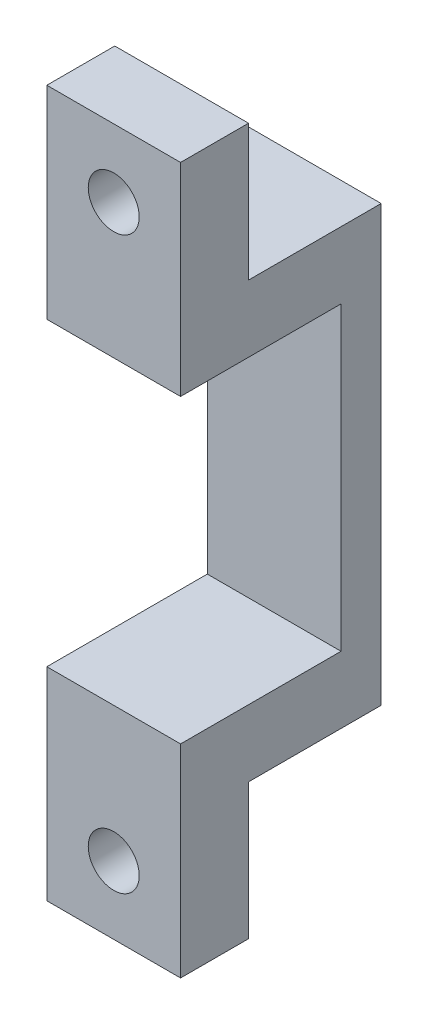
ISO-10303-21;
HEADER;
FILE_DESCRIPTION(('STEP AP214'),'2;1');
FILE_NAME('part.step','',(''),(''),'','','');
FILE_SCHEMA(('AUTOMOTIVE_DESIGN { 1 0 10303 214 1 1 1 1 }'));
ENDSEC;
DATA;
#1=APPLICATION_CONTEXT('core data for automotive mechanical design processes');
#2=APPLICATION_PROTOCOL_DEFINITION('international standard','automotive_design',2000,#1);
#3=PRODUCT_CONTEXT('',#1,'mechanical');
#4=PRODUCT('Part','Part','',(#3));
#5=PRODUCT_RELATED_PRODUCT_CATEGORY('part','',(#4));
#6=PRODUCT_DEFINITION_FORMATION('','',#4);
#7=PRODUCT_DEFINITION_CONTEXT('part definition',#1,'design');
#8=PRODUCT_DEFINITION('design','',#6,#7);
#9=PRODUCT_DEFINITION_SHAPE('','',#8);
#10=(LENGTH_UNIT() NAMED_UNIT(*) SI_UNIT(.MILLI.,.METRE.));
#11=(NAMED_UNIT(*) PLANE_ANGLE_UNIT() SI_UNIT($,.RADIAN.));
#12=(NAMED_UNIT(*) SI_UNIT($,.STERADIAN.) SOLID_ANGLE_UNIT());
#13=UNCERTAINTY_MEASURE_WITH_UNIT(LENGTH_MEASURE(1.E-05),#10,'distance_accuracy_value','');
#14=(GEOMETRIC_REPRESENTATION_CONTEXT(3) GLOBAL_UNCERTAINTY_ASSIGNED_CONTEXT((#13)) GLOBAL_UNIT_ASSIGNED_CONTEXT((#10,
#11,#12)) REPRESENTATION_CONTEXT('',''));
#15=CARTESIAN_POINT('',(0.,0.,0.));
#16=DIRECTION('',(0.,0.,1.));
#17=DIRECTION('',(1.,0.,0.));
#18=AXIS2_PLACEMENT_3D('',#15,#16,#17);
#19=CARTESIAN_POINT('',(10.0000054,0.,0.));
#20=DIRECTION('',(-1.,0.,0.));
#21=DIRECTION('',(0.,0.,1.));
#22=AXIS2_PLACEMENT_3D('',#19,#20,#21);
#23=PLANE('',#22);
#24=DIRECTION('',(0.,1.,0.));
#25=VECTOR('',#24,1.);
#26=CARTESIAN_POINT('',(10.0000054,-37.65999072,9.9199954));
#27=LINE('',#26,#25);
#28=CARTESIAN_POINT('',(10.0000054,-37.65999072,9.9199954));
#29=VERTEX_POINT('',#28);
#30=CARTESIAN_POINT('',(10.0000054,-27.49999072,9.9199954));
#31=VERTEX_POINT('',#30);
#32=EDGE_CURVE('E52',#29,#31,#27,.T.);
#33=ORIENTED_EDGE('',*,*,#32,.T.);
#34=DIRECTION('',(0.,0.,-1.));
#35=VECTOR('',#34,1.);
#36=CARTESIAN_POINT('',(10.0000054,-27.49999072,9.9199954));
#37=LINE('',#36,#35);
#38=CARTESIAN_POINT('',(10.0000054,-27.49999072,0.));
#39=VERTEX_POINT('',#38);
#40=EDGE_CURVE('E151',#31,#39,#37,.T.);
#41=ORIENTED_EDGE('',*,*,#40,.T.);
#42=DIRECTION('',(0.,-1.,0.));
#43=VECTOR('',#42,1.);
#44=CARTESIAN_POINT('',(10.0000054,15.15999,0.));
#45=LINE('',#44,#43);
#46=CARTESIAN_POINT('',(10.0000054,4.99999,0.));
#47=VERTEX_POINT('',#46);
#48=EDGE_CURVE('E45',#47,#39,#45,.T.);
#49=ORIENTED_EDGE('',*,*,#48,.F.);
#50=DIRECTION('',(0.,0.,-1.));
#51=VECTOR('',#50,1.);
#52=CARTESIAN_POINT('',(10.0000054,4.99999,9.9199954));
#53=LINE('',#52,#51);
#54=CARTESIAN_POINT('',(10.0000054,4.99999,9.9199954));
#55=VERTEX_POINT('',#54);
#56=EDGE_CURVE('E204',#55,#47,#53,.T.);
#57=ORIENTED_EDGE('',*,*,#56,.F.);
#58=DIRECTION('',(0.,-1.,0.));
#59=VECTOR('',#58,1.);
#60=CARTESIAN_POINT('',(10.0000054,15.15999,9.9199954));
#61=LINE('',#60,#59);
#62=CARTESIAN_POINT('',(10.0000054,15.15999,9.9199954));
#63=VERTEX_POINT('',#62);
#64=EDGE_CURVE('E200',#63,#55,#61,.T.);
#65=ORIENTED_EDGE('',*,*,#64,.F.);
#66=DIRECTION('',(0.,0.,-1.));
#67=VECTOR('',#66,1.);
#68=CARTESIAN_POINT('',(10.0000054,15.15999,14.9999954));
#69=LINE('',#68,#67);
#70=CARTESIAN_POINT('',(10.0000054,15.15999,14.9999954));
#71=VERTEX_POINT('',#70);
#72=EDGE_CURVE('E235',#71,#63,#69,.T.);
#73=ORIENTED_EDGE('',*,*,#72,.F.);
#74=DIRECTION('',(0.,1.,0.));
#75=VECTOR('',#74,1.);
#76=CARTESIAN_POINT('',(10.0000054,-11.25000036,14.9999954));
#77=LINE('',#76,#75);
#78=CARTESIAN_POINT('',(10.0000054,0.,14.9999954));
#79=VERTEX_POINT('',#78);
#80=EDGE_CURVE('E233',#79,#71,#77,.T.);
#81=ORIENTED_EDGE('',*,*,#80,.F.);
#82=DIRECTION('',(0.,0.,1.));
#83=VECTOR('',#82,1.);
#84=CARTESIAN_POINT('',(10.0000054,0.,2.999994));
#85=LINE('',#84,#83);
#86=CARTESIAN_POINT('',(10.0000054,0.,2.999994));
#87=VERTEX_POINT('',#86);
#88=EDGE_CURVE('E221',#87,#79,#85,.T.);
#89=ORIENTED_EDGE('',*,*,#88,.F.);
#90=DIRECTION('',(0.,1.,0.));
#91=VECTOR('',#90,1.);
#92=CARTESIAN_POINT('',(10.0000054,-11.25000036,2.999994));
#93=LINE('',#92,#91);
#94=CARTESIAN_POINT('',(10.0000054,-22.50000072,2.999994));
#95=VERTEX_POINT('',#94);
#96=EDGE_CURVE('E213',#95,#87,#93,.T.);
#97=ORIENTED_EDGE('',*,*,#96,.F.);
#98=DIRECTION('',(0.,0.,1.));
#99=VECTOR('',#98,1.);
#100=CARTESIAN_POINT('',(10.0000054,-22.50000072,2.999994));
#101=LINE('',#100,#99);
#102=CARTESIAN_POINT('',(10.0000054,-22.50000072,14.9999954));
#103=VERTEX_POINT('',#102);
#104=EDGE_CURVE('E162',#95,#103,#101,.T.);
#105=ORIENTED_EDGE('',*,*,#104,.T.);
#106=DIRECTION('',(0.,-1.,0.));
#107=VECTOR('',#106,1.);
#108=CARTESIAN_POINT('',(10.0000054,-11.25000036,14.9999954));
#109=LINE('',#108,#107);
#110=CARTESIAN_POINT('',(10.0000054,-37.65999072,14.9999954));
#111=VERTEX_POINT('',#110);
#112=EDGE_CURVE('E176',#103,#111,#109,.T.);
#113=ORIENTED_EDGE('',*,*,#112,.T.);
#114=DIRECTION('',(0.,0.,-1.));
#115=VECTOR('',#114,1.);
#116=CARTESIAN_POINT('',(10.0000054,-37.65999072,14.9999954));
#117=LINE('',#116,#115);
#118=EDGE_CURVE('E178',#111,#29,#117,.T.);
#119=ORIENTED_EDGE('',*,*,#118,.T.);
#120=EDGE_LOOP('',(#33,#41,#49,#57,#65,#73,#81,#89,#97,#105,#113,#119));
#121=FACE_BOUND('',#120,.T.);
#122=ADVANCED_FACE('F37',(#121),#23,.F.);
#123=CARTESIAN_POINT('',(0.,0.,0.));
#124=DIRECTION('',(-1.,0.,0.));
#125=DIRECTION('',(0.,0.,1.));
#126=AXIS2_PLACEMENT_3D('',#123,#124,#125);
#127=PLANE('',#126);
#128=CARTESIAN_POINT('',(0.,-25.0000008,9.4881954));
#129=DIRECTION('',(-1.,0.,0.));
#130=DIRECTION('',(0.,0.,1.));
#131=AXIS2_PLACEMENT_3D('',#128,#129,#130);
#132=CIRCLE('',#131,0.600000069999988);
#133=CARTESIAN_POINT('',(0.,-25.0000008,10.08819547));
#134=VERTEX_POINT('',#133);
#135=EDGE_CURVE('E141',#134,#134,#132,.T.);
#136=ORIENTED_EDGE('',*,*,#135,.F.);
#137=EDGE_LOOP('',(#136));
#138=FACE_BOUND('',#137,.T.);
#139=CARTESIAN_POINT('',(0.,2.50000008,9.4881954));
#140=DIRECTION('',(-1.,0.,0.));
#141=DIRECTION('',(0.,0.,1.));
#142=AXIS2_PLACEMENT_3D('',#139,#140,#141);
#143=CIRCLE('',#142,0.60000006999999);
#144=CARTESIAN_POINT('',(0.,2.50000008,10.08819547));
#145=VERTEX_POINT('',#144);
#146=EDGE_CURVE('E188',#145,#145,#143,.T.);
#147=ORIENTED_EDGE('',*,*,#146,.F.);
#148=EDGE_LOOP('',(#147));
#149=FACE_BOUND('',#148,.T.);
#150=DIRECTION('',(0.,0.,-1.));
#151=VECTOR('',#150,1.);
#152=CARTESIAN_POINT('',(0.,-27.49999072,9.9199954));
#153=LINE('',#152,#151);
#154=CARTESIAN_POINT('',(0.,-27.49999072,9.9199954));
#155=VERTEX_POINT('',#154);
#156=CARTESIAN_POINT('',(0.,-27.49999072,0.));
#157=VERTEX_POINT('',#156);
#158=EDGE_CURVE('E152',#155,#157,#153,.T.);
#159=ORIENTED_EDGE('',*,*,#158,.F.);
#160=DIRECTION('',(0.,1.,0.));
#161=VECTOR('',#160,1.);
#162=CARTESIAN_POINT('',(0.,-37.65999072,9.9199954));
#163=LINE('',#162,#161);
#164=CARTESIAN_POINT('',(0.,-37.65999072,9.9199954));
#165=VERTEX_POINT('',#164);
#166=EDGE_CURVE('E154',#165,#155,#163,.T.);
#167=ORIENTED_EDGE('',*,*,#166,.F.);
#168=DIRECTION('',(0.,0.,-1.));
#169=VECTOR('',#168,1.);
#170=CARTESIAN_POINT('',(0.,-37.65999072,14.9999954));
#171=LINE('',#170,#169);
#172=CARTESIAN_POINT('',(0.,-37.65999072,14.9999954));
#173=VERTEX_POINT('',#172);
#174=EDGE_CURVE('E179',#173,#165,#171,.T.);
#175=ORIENTED_EDGE('',*,*,#174,.F.);
#176=DIRECTION('',(0.,-1.,0.));
#177=VECTOR('',#176,1.);
#178=CARTESIAN_POINT('',(0.,-11.25000036,14.9999954));
#179=LINE('',#178,#177);
#180=CARTESIAN_POINT('',(0.,-22.50000072,14.9999954));
#181=VERTEX_POINT('',#180);
#182=EDGE_CURVE('E174',#181,#173,#179,.T.);
#183=ORIENTED_EDGE('',*,*,#182,.F.);
#184=DIRECTION('',(0.,0.,1.));
#185=VECTOR('',#184,1.);
#186=CARTESIAN_POINT('',(0.,-22.50000072,2.999994));
#187=LINE('',#186,#185);
#188=CARTESIAN_POINT('',(0.,-22.50000072,2.999994));
#189=VERTEX_POINT('',#188);
#190=EDGE_CURVE('E166',#189,#181,#187,.T.);
#191=ORIENTED_EDGE('',*,*,#190,.F.);
#192=DIRECTION('',(0.,1.,0.));
#193=VECTOR('',#192,1.);
#194=CARTESIAN_POINT('',(0.,-11.25000036,2.999994));
#195=LINE('',#194,#193);
#196=CARTESIAN_POINT('',(0.,0.,2.999994));
#197=VERTEX_POINT('',#196);
#198=EDGE_CURVE('E217',#189,#197,#195,.T.);
#199=ORIENTED_EDGE('',*,*,#198,.T.);
#200=DIRECTION('',(0.,0.,1.));
#201=VECTOR('',#200,1.);
#202=CARTESIAN_POINT('',(0.,0.,2.999994));
#203=LINE('',#202,#201);
#204=CARTESIAN_POINT('',(0.,0.,14.9999954));
#205=VERTEX_POINT('',#204);
#206=EDGE_CURVE('E220',#197,#205,#203,.T.);
#207=ORIENTED_EDGE('',*,*,#206,.T.);
#208=DIRECTION('',(0.,1.,0.));
#209=VECTOR('',#208,1.);
#210=CARTESIAN_POINT('',(0.,-11.25000036,14.9999954));
#211=LINE('',#210,#209);
#212=CARTESIAN_POINT('',(0.,15.15999,14.9999954));
#213=VERTEX_POINT('',#212);
#214=EDGE_CURVE('E231',#205,#213,#211,.T.);
#215=ORIENTED_EDGE('',*,*,#214,.T.);
#216=DIRECTION('',(0.,0.,-1.));
#217=VECTOR('',#216,1.);
#218=CARTESIAN_POINT('',(0.,15.15999,14.9999954));
#219=LINE('',#218,#217);
#220=CARTESIAN_POINT('',(0.,15.15999,9.9199954));
#221=VERTEX_POINT('',#220);
#222=EDGE_CURVE('E242',#213,#221,#219,.T.);
#223=ORIENTED_EDGE('',*,*,#222,.T.);
#224=DIRECTION('',(0.,-1.,0.));
#225=VECTOR('',#224,1.);
#226=CARTESIAN_POINT('',(0.,15.15999,9.9199954));
#227=LINE('',#226,#225);
#228=CARTESIAN_POINT('',(0.,4.99999,9.9199954));
#229=VERTEX_POINT('',#228);
#230=EDGE_CURVE('E201',#221,#229,#227,.T.);
#231=ORIENTED_EDGE('',*,*,#230,.T.);
#232=DIRECTION('',(0.,0.,-1.));
#233=VECTOR('',#232,1.);
#234=CARTESIAN_POINT('',(0.,4.99999,9.9199954));
#235=LINE('',#234,#233);
#236=CARTESIAN_POINT('',(0.,4.99999,0.));
#237=VERTEX_POINT('',#236);
#238=EDGE_CURVE('E60',#229,#237,#235,.T.);
#239=ORIENTED_EDGE('',*,*,#238,.T.);
#240=DIRECTION('',(0.,-1.,0.));
#241=VECTOR('',#240,1.);
#242=CARTESIAN_POINT('',(0.,15.15999,0.));
#243=LINE('',#242,#241);
#244=EDGE_CURVE('E236',#237,#157,#243,.T.);
#245=ORIENTED_EDGE('',*,*,#244,.T.);
#246=EDGE_LOOP('',(#159,#167,#175,#183,#191,#199,#207,#215,#223,#231,#239,#245));
#247=FACE_BOUND('',#246,.T.);
#248=ADVANCED_FACE('F248',(#138,#149,#247),#127,.T.);
#249=CARTESIAN_POINT('',(10.0000054,15.15999,0.));
#250=DIRECTION('',(0.,0.,-1.));
#251=DIRECTION('',(-1.,0.,0.));
#252=AXIS2_PLACEMENT_3D('',#249,#250,#251);
#253=PLANE('',#252);
#254=ORIENTED_EDGE('',*,*,#48,.T.);
#255=DIRECTION('',(1.,0.,0.));
#256=VECTOR('',#255,1.);
#257=CARTESIAN_POINT('',(0.,-27.49999072,0.));
#258=LINE('',#257,#256);
#259=EDGE_CURVE('E156',#157,#39,#258,.T.);
#260=ORIENTED_EDGE('',*,*,#259,.F.);
#261=ORIENTED_EDGE('',*,*,#244,.F.);
#262=DIRECTION('',(1.,0.,0.));
#263=VECTOR('',#262,1.);
#264=CARTESIAN_POINT('',(0.,4.99999,0.));
#265=LINE('',#264,#263);
#266=EDGE_CURVE('E210',#237,#47,#265,.T.);
#267=ORIENTED_EDGE('',*,*,#266,.T.);
#268=EDGE_LOOP('',(#254,#260,#261,#267));
#269=FACE_BOUND('',#268,.T.);
#270=ADVANCED_FACE('F252',(#269),#253,.T.);
#271=CARTESIAN_POINT('',(10.0000054,-37.65999072,14.9999954));
#272=DIRECTION('',(0.,1.,0.));
#273=DIRECTION('',(0.,0.,1.));
#274=AXIS2_PLACEMENT_3D('',#271,#272,#273);
#275=PLANE('',#274);
#276=DIRECTION('',(1.,0.,0.));
#277=VECTOR('',#276,1.);
#278=CARTESIAN_POINT('',(0.,-37.65999072,9.9199954));
#279=LINE('',#278,#277);
#280=EDGE_CURVE('E160',#165,#29,#279,.T.);
#281=ORIENTED_EDGE('',*,*,#280,.T.);
#282=ORIENTED_EDGE('',*,*,#118,.F.);
#283=DIRECTION('',(-1.,0.,0.));
#284=VECTOR('',#283,1.);
#285=CARTESIAN_POINT('',(10.0000054,-37.65999072,14.9999954));
#286=LINE('',#285,#284);
#287=EDGE_CURVE('E182',#111,#173,#286,.T.);
#288=ORIENTED_EDGE('',*,*,#287,.T.);
#289=ORIENTED_EDGE('',*,*,#174,.T.);
#290=EDGE_LOOP('',(#281,#282,#288,#289));
#291=FACE_BOUND('',#290,.T.);
#292=ADVANCED_FACE('F264',(#291),#275,.F.);
#293=CARTESIAN_POINT('',(10.0000054,-11.25000036,14.9999954));
#294=DIRECTION('',(0.,0.,-1.));
#295=DIRECTION('',(-1.,0.,0.));
#296=AXIS2_PLACEMENT_3D('',#293,#294,#295);
#297=PLANE('',#296);
#298=CARTESIAN_POINT('',(4.99999,-32.57999072,14.9999954));
#299=DIRECTION('',(0.,0.,-1.));
#300=DIRECTION('',(-1.,0.,0.));
#301=AXIS2_PLACEMENT_3D('',#298,#299,#300);
#302=CIRCLE('',#301,1.90499999999999);
#303=CARTESIAN_POINT('',(3.09499000000001,-32.57999072,14.9999954));
#304=VERTEX_POINT('',#303);
#305=EDGE_CURVE('E144',#304,#304,#302,.T.);
#306=ORIENTED_EDGE('',*,*,#305,.T.);
#307=EDGE_LOOP('',(#306));
#308=FACE_BOUND('',#307,.T.);
#309=DIRECTION('',(1.,0.,0.));
#310=VECTOR('',#309,1.);
#311=CARTESIAN_POINT('',(0.,-22.50000072,14.9999954));
#312=LINE('',#311,#310);
#313=EDGE_CURVE('E168',#181,#103,#312,.T.);
#314=ORIENTED_EDGE('',*,*,#313,.F.);
#315=ORIENTED_EDGE('',*,*,#182,.T.);
#316=ORIENTED_EDGE('',*,*,#287,.F.);
#317=ORIENTED_EDGE('',*,*,#112,.F.);
#318=EDGE_LOOP('',(#314,#315,#316,#317));
#319=FACE_BOUND('',#318,.T.);
#320=ADVANCED_FACE('F267',(#308,#319),#297,.F.);
#321=CARTESIAN_POINT('',(0.,15.15999,9.9199954));
#322=DIRECTION('',(0.,0.,1.));
#323=DIRECTION('',(1.,0.,0.));
#324=AXIS2_PLACEMENT_3D('',#321,#322,#323);
#325=PLANE('',#324);
#326=ORIENTED_EDGE('',*,*,#64,.T.);
#327=DIRECTION('',(1.,0.,0.));
#328=VECTOR('',#327,1.);
#329=CARTESIAN_POINT('',(0.,4.99999,9.9199954));
#330=LINE('',#329,#328);
#331=EDGE_CURVE('E214',#229,#55,#330,.T.);
#332=ORIENTED_EDGE('',*,*,#331,.F.);
#333=ORIENTED_EDGE('',*,*,#230,.F.);
#334=DIRECTION('',(1.,0.,0.));
#335=VECTOR('',#334,1.);
#336=CARTESIAN_POINT('',(0.,15.15999,9.9199954));
#337=LINE('',#336,#335);
#338=EDGE_CURVE('E206',#221,#63,#337,.T.);
#339=ORIENTED_EDGE('',*,*,#338,.T.);
#340=EDGE_LOOP('',(#326,#332,#333,#339));
#341=FACE_BOUND('',#340,.T.);
#342=CARTESIAN_POINT('',(4.99999,10.07999,9.9199954));
#343=DIRECTION('',(0.,0.,-1.));
#344=DIRECTION('',(-1.,0.,0.));
#345=AXIS2_PLACEMENT_3D('',#342,#343,#344);
#346=CIRCLE('',#345,1.90499999999999);
#347=CARTESIAN_POINT('',(3.09499000000001,10.07999,9.9199954));
#348=VERTEX_POINT('',#347);
#349=EDGE_CURVE('E194',#348,#348,#346,.T.);
#350=ORIENTED_EDGE('',*,*,#349,.F.);
#351=EDGE_LOOP('',(#350));
#352=FACE_BOUND('',#351,.T.);
#353=ADVANCED_FACE('F307',(#341,#352),#325,.F.);
#354=CARTESIAN_POINT('',(10.0000054,-11.25000036,14.9999954));
#355=DIRECTION('',(0.,0.,1.));
#356=DIRECTION('',(1.,0.,0.));
#357=AXIS2_PLACEMENT_3D('',#354,#355,#356);
#358=PLANE('',#357);
#359=CARTESIAN_POINT('',(4.99999,10.07999,14.9999954));
#360=DIRECTION('',(0.,0.,-1.));
#361=DIRECTION('',(-1.,0.,0.));
#362=AXIS2_PLACEMENT_3D('',#359,#360,#361);
#363=CIRCLE('',#362,1.90499999999999);
#364=CARTESIAN_POINT('',(3.09499000000001,10.07999,14.9999954));
#365=VERTEX_POINT('',#364);
#366=EDGE_CURVE('E197',#365,#365,#363,.T.);
#367=ORIENTED_EDGE('',*,*,#366,.T.);
#368=EDGE_LOOP('',(#367));
#369=FACE_BOUND('',#368,.T.);
#370=DIRECTION('',(1.,0.,0.));
#371=VECTOR('',#370,1.);
#372=CARTESIAN_POINT('',(0.,0.,14.9999954));
#373=LINE('',#372,#371);
#374=EDGE_CURVE('E228',#205,#79,#373,.T.);
#375=ORIENTED_EDGE('',*,*,#374,.T.);
#376=ORIENTED_EDGE('',*,*,#80,.T.);
#377=DIRECTION('',(-1.,0.,0.));
#378=VECTOR('',#377,1.);
#379=CARTESIAN_POINT('',(10.0000054,15.15999,14.9999954));
#380=LINE('',#379,#378);
#381=EDGE_CURVE('E11',#71,#213,#380,.T.);
#382=ORIENTED_EDGE('',*,*,#381,.T.);
#383=ORIENTED_EDGE('',*,*,#214,.F.);
#384=EDGE_LOOP('',(#375,#376,#382,#383));
#385=FACE_BOUND('',#384,.T.);
#386=ADVANCED_FACE('F39',(#369,#385),#358,.T.);
#387=CARTESIAN_POINT('',(10.0000054,15.15999,14.9999954));
#388=DIRECTION('',(0.,1.,0.));
#389=DIRECTION('',(0.,0.,1.));
#390=AXIS2_PLACEMENT_3D('',#387,#388,#389);
#391=PLANE('',#390);
#392=ORIENTED_EDGE('',*,*,#338,.F.);
#393=ORIENTED_EDGE('',*,*,#222,.F.);
#394=ORIENTED_EDGE('',*,*,#381,.F.);
#395=ORIENTED_EDGE('',*,*,#72,.T.);
#396=EDGE_LOOP('',(#392,#393,#394,#395));
#397=FACE_BOUND('',#396,.T.);
#398=ADVANCED_FACE('F298',(#397),#391,.T.);
#399=CARTESIAN_POINT('',(0.,-11.25000036,2.999994));
#400=DIRECTION('',(0.,0.,-1.));
#401=DIRECTION('',(0.,1.,0.));
#402=AXIS2_PLACEMENT_3D('',#399,#400,#401);
#403=PLANE('',#402);
#404=ORIENTED_EDGE('',*,*,#96,.T.);
#405=DIRECTION('',(1.,0.,0.));
#406=VECTOR('',#405,1.);
#407=CARTESIAN_POINT('',(0.,0.,2.999994));
#408=LINE('',#407,#406);
#409=EDGE_CURVE('E224',#197,#87,#408,.T.);
#410=ORIENTED_EDGE('',*,*,#409,.F.);
#411=ORIENTED_EDGE('',*,*,#198,.F.);
#412=DIRECTION('',(1.,0.,0.));
#413=VECTOR('',#412,1.);
#414=CARTESIAN_POINT('',(0.,-22.50000072,2.999994));
#415=LINE('',#414,#413);
#416=EDGE_CURVE('E171',#189,#95,#415,.T.);
#417=ORIENTED_EDGE('',*,*,#416,.T.);
#418=EDGE_LOOP('',(#404,#410,#411,#417));
#419=FACE_BOUND('',#418,.T.);
#420=ADVANCED_FACE('F294',(#419),#403,.F.);
#421=CARTESIAN_POINT('',(0.,0.,2.999994));
#422=DIRECTION('',(0.,1.,0.));
#423=DIRECTION('',(0.,0.,1.));
#424=AXIS2_PLACEMENT_3D('',#421,#422,#423);
#425=PLANE('',#424);
#426=ORIENTED_EDGE('',*,*,#88,.T.);
#427=ORIENTED_EDGE('',*,*,#374,.F.);
#428=ORIENTED_EDGE('',*,*,#206,.F.);
#429=ORIENTED_EDGE('',*,*,#409,.T.);
#430=EDGE_LOOP('',(#426,#427,#428,#429));
#431=FACE_BOUND('',#430,.T.);
#432=ADVANCED_FACE('F305',(#431),#425,.F.);
#433=CARTESIAN_POINT('',(0.,4.99999,9.9199954));
#434=DIRECTION('',(0.,-1.,0.));
#435=DIRECTION('',(0.,0.,-1.));
#436=AXIS2_PLACEMENT_3D('',#433,#434,#435);
#437=PLANE('',#436);
#438=ORIENTED_EDGE('',*,*,#56,.T.);
#439=ORIENTED_EDGE('',*,*,#266,.F.);
#440=ORIENTED_EDGE('',*,*,#238,.F.);
#441=ORIENTED_EDGE('',*,*,#331,.T.);
#442=EDGE_LOOP('',(#438,#439,#440,#441));
#443=FACE_BOUND('',#442,.T.);
#444=ADVANCED_FACE('F321',(#443),#437,.F.);
#445=CARTESIAN_POINT('',(4.99999,10.07999,9.9199954));
#446=DIRECTION('',(0.,0.,-1.));
#447=DIRECTION('',(-1.,0.,0.));
#448=AXIS2_PLACEMENT_3D('',#445,#446,#447);
#449=CYLINDRICAL_SURFACE('',#448,1.90499999999999);
#450=ORIENTED_EDGE('',*,*,#366,.F.);
#451=EDGE_LOOP('',(#450));
#452=FACE_BOUND('',#451,.T.);
#453=ORIENTED_EDGE('',*,*,#349,.T.);
#454=EDGE_LOOP('',(#453));
#455=FACE_BOUND('',#454,.T.);
#456=ADVANCED_FACE('F323',(#452,#455),#449,.F.);
#457=CARTESIAN_POINT('',(4.99999,2.50000008,9.4881954));
#458=DIRECTION('',(-1.,0.,0.));
#459=DIRECTION('',(0.,0.,1.));
#460=AXIS2_PLACEMENT_3D('',#457,#458,#459);
#461=CONICAL_SURFACE('',#460,0.600000069999988,1.02974425867664);
#462=CARTESIAN_POINT('',(5.36050641347678,2.50000008,9.4881954));
#463=VERTEX_POINT('',#462);
#464=VERTEX_LOOP('',#463);
#465=FACE_BOUND('',#464,.T.);
#466=CARTESIAN_POINT('',(4.99999,2.50000008,9.4881954));
#467=DIRECTION('',(-1.,0.,0.));
#468=DIRECTION('',(0.,0.,1.));
#469=AXIS2_PLACEMENT_3D('',#466,#467,#468);
#470=CIRCLE('',#469,0.600000069999988);
#471=CARTESIAN_POINT('',(4.99999,2.50000008,10.08819547));
#472=VERTEX_POINT('',#471);
#473=EDGE_CURVE('E191',#472,#472,#470,.T.);
#474=ORIENTED_EDGE('',*,*,#473,.T.);
#475=EDGE_LOOP('',(#474));
#476=FACE_BOUND('',#475,.T.);
#477=ADVANCED_FACE('F329',(#465,#476),#461,.F.);
#478=CARTESIAN_POINT('',(0.,2.50000008,9.4881954));
#479=DIRECTION('',(-1.,0.,0.));
#480=DIRECTION('',(0.,0.,1.));
#481=AXIS2_PLACEMENT_3D('',#478,#479,#480);
#482=CYLINDRICAL_SURFACE('',#481,0.600000069999989);
#483=ORIENTED_EDGE('',*,*,#473,.F.);
#484=EDGE_LOOP('',(#483));
#485=FACE_BOUND('',#484,.T.);
#486=ORIENTED_EDGE('',*,*,#146,.T.);
#487=EDGE_LOOP('',(#486));
#488=FACE_BOUND('',#487,.T.);
#489=ADVANCED_FACE('F281',(#485,#488),#482,.F.);
#490=CARTESIAN_POINT('',(0.,-22.50000072,2.999994));
#491=DIRECTION('',(0.,1.,0.));
#492=DIRECTION('',(0.,0.,1.));
#493=AXIS2_PLACEMENT_3D('',#490,#491,#492);
#494=PLANE('',#493);
#495=ORIENTED_EDGE('',*,*,#104,.F.);
#496=ORIENTED_EDGE('',*,*,#416,.F.);
#497=ORIENTED_EDGE('',*,*,#190,.T.);
#498=ORIENTED_EDGE('',*,*,#313,.T.);
#499=EDGE_LOOP('',(#495,#496,#497,#498));
#500=FACE_BOUND('',#499,.T.);
#501=ADVANCED_FACE('F273',(#500),#494,.T.);
#502=CARTESIAN_POINT('',(0.,-37.65999072,9.9199954));
#503=DIRECTION('',(0.,0.,-1.));
#504=DIRECTION('',(-1.,0.,0.));
#505=AXIS2_PLACEMENT_3D('',#502,#503,#504);
#506=PLANE('',#505);
#507=CARTESIAN_POINT('',(4.99999,-32.57999072,9.9199954));
#508=DIRECTION('',(0.,0.,-1.));
#509=DIRECTION('',(-1.,0.,0.));
#510=AXIS2_PLACEMENT_3D('',#507,#508,#509);
#511=CIRCLE('',#510,1.90499999999999);
#512=CARTESIAN_POINT('',(3.09499000000001,-32.57999072,9.9199954));
#513=VERTEX_POINT('',#512);
#514=EDGE_CURVE('E140',#513,#513,#511,.T.);
#515=ORIENTED_EDGE('',*,*,#514,.F.);
#516=EDGE_LOOP('',(#515));
#517=FACE_BOUND('',#516,.T.);
#518=ORIENTED_EDGE('',*,*,#32,.F.);
#519=ORIENTED_EDGE('',*,*,#280,.F.);
#520=ORIENTED_EDGE('',*,*,#166,.T.);
#521=DIRECTION('',(1.,0.,0.));
#522=VECTOR('',#521,1.);
#523=CARTESIAN_POINT('',(0.,-27.49999072,9.9199954));
#524=LINE('',#523,#522);
#525=EDGE_CURVE('E163',#155,#31,#524,.T.);
#526=ORIENTED_EDGE('',*,*,#525,.T.);
#527=EDGE_LOOP('',(#518,#519,#520,#526));
#528=FACE_BOUND('',#527,.T.);
#529=ADVANCED_FACE('F271',(#517,#528),#506,.T.);
#530=CARTESIAN_POINT('',(0.,-27.49999072,9.9199954));
#531=DIRECTION('',(0.,-1.,0.));
#532=DIRECTION('',(0.,0.,-1.));
#533=AXIS2_PLACEMENT_3D('',#530,#531,#532);
#534=PLANE('',#533);
#535=ORIENTED_EDGE('',*,*,#40,.F.);
#536=ORIENTED_EDGE('',*,*,#525,.F.);
#537=ORIENTED_EDGE('',*,*,#158,.T.);
#538=ORIENTED_EDGE('',*,*,#259,.T.);
#539=EDGE_LOOP('',(#535,#536,#537,#538));
#540=FACE_BOUND('',#539,.T.);
#541=ADVANCED_FACE('F256',(#540),#534,.T.);
#542=CARTESIAN_POINT('',(4.99999,-32.57999072,9.9199954));
#543=DIRECTION('',(0.,0.,-1.));
#544=DIRECTION('',(-1.,0.,0.));
#545=AXIS2_PLACEMENT_3D('',#542,#543,#544);
#546=CYLINDRICAL_SURFACE('',#545,1.90499999999999);
#547=ORIENTED_EDGE('',*,*,#305,.F.);
#548=EDGE_LOOP('',(#547));
#549=FACE_BOUND('',#548,.T.);
#550=ORIENTED_EDGE('',*,*,#514,.T.);
#551=EDGE_LOOP('',(#550));
#552=FACE_BOUND('',#551,.T.);
#553=ADVANCED_FACE('F134',(#549,#552),#546,.F.);
#554=CARTESIAN_POINT('',(4.99999,-25.0000008,9.4881954));
#555=DIRECTION('',(-1.,0.,0.));
#556=DIRECTION('',(0.,0.,1.));
#557=AXIS2_PLACEMENT_3D('',#554,#555,#556);
#558=CONICAL_SURFACE('',#557,0.600000069999988,1.02974425867664);
#559=CARTESIAN_POINT('',(5.36050641347678,-25.0000008,9.4881954));
#560=VERTEX_POINT('',#559);
#561=VERTEX_LOOP('',#560);
#562=FACE_BOUND('',#561,.T.);
#563=CARTESIAN_POINT('',(4.99999,-25.0000008,9.4881954));
#564=DIRECTION('',(-1.,0.,0.));
#565=DIRECTION('',(0.,0.,1.));
#566=AXIS2_PLACEMENT_3D('',#563,#564,#565);
#567=CIRCLE('',#566,0.600000069999988);
#568=CARTESIAN_POINT('',(4.99999,-25.0000008,10.08819547));
#569=VERTEX_POINT('',#568);
#570=EDGE_CURVE('E138',#569,#569,#567,.T.);
#571=ORIENTED_EDGE('',*,*,#570,.T.);
#572=EDGE_LOOP('',(#571));
#573=FACE_BOUND('',#572,.T.);
#574=ADVANCED_FACE('F130',(#562,#573),#558,.F.);
#575=CARTESIAN_POINT('',(0.,-25.0000008,9.4881954));
#576=DIRECTION('',(-1.,0.,0.));
#577=DIRECTION('',(0.,0.,1.));
#578=AXIS2_PLACEMENT_3D('',#575,#576,#577);
#579=CYLINDRICAL_SURFACE('',#578,0.600000069999988);
#580=ORIENTED_EDGE('',*,*,#570,.F.);
#581=EDGE_LOOP('',(#580));
#582=FACE_BOUND('',#581,.T.);
#583=ORIENTED_EDGE('',*,*,#135,.T.);
#584=EDGE_LOOP('',(#583));
#585=FACE_BOUND('',#584,.T.);
#586=ADVANCED_FACE('F133',(#582,#585),#579,.F.);
#587=CLOSED_SHELL('',(#122,#248,#270,#292,#320,#353,#386,#398,#420,#432,#444,#456,#477,#489,
#501,#529,#541,#553,#574,#586));
#588=MANIFOLD_SOLID_BREP('B2',#587);
#589=ADVANCED_BREP_SHAPE_REPRESENTATION('',(#18,#588),#14);
#590=SHAPE_DEFINITION_REPRESENTATION(#9,#589);
ENDSEC;
END-ISO-10303-21;
